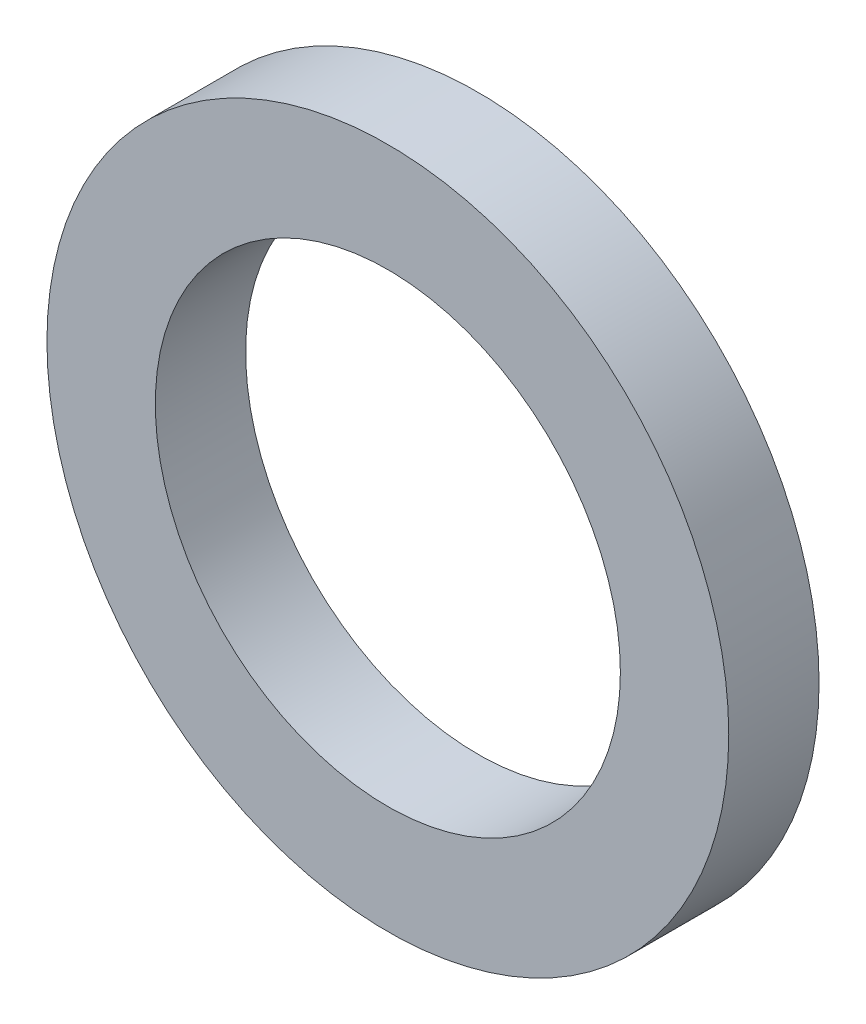
ISO-10303-21;
HEADER;
FILE_DESCRIPTION(('STEP AP214'),'2;1');
FILE_NAME('part.step','',(''),(''),'','','');
FILE_SCHEMA(('AUTOMOTIVE_DESIGN { 1 0 10303 214 1 1 1 1 }'));
ENDSEC;
DATA;
#1=APPLICATION_CONTEXT('core data for automotive mechanical design processes');
#2=APPLICATION_PROTOCOL_DEFINITION('international standard','automotive_design',2000,#1);
#3=PRODUCT_CONTEXT('',#1,'mechanical');
#4=PRODUCT('Part','Part','',(#3));
#5=PRODUCT_RELATED_PRODUCT_CATEGORY('part','',(#4));
#6=PRODUCT_DEFINITION_FORMATION('','',#4);
#7=PRODUCT_DEFINITION_CONTEXT('part definition',#1,'design');
#8=PRODUCT_DEFINITION('design','',#6,#7);
#9=PRODUCT_DEFINITION_SHAPE('','',#8);
#10=(LENGTH_UNIT() NAMED_UNIT(*) SI_UNIT(.MILLI.,.METRE.));
#11=(NAMED_UNIT(*) PLANE_ANGLE_UNIT() SI_UNIT($,.RADIAN.));
#12=(NAMED_UNIT(*) SI_UNIT($,.STERADIAN.) SOLID_ANGLE_UNIT());
#13=UNCERTAINTY_MEASURE_WITH_UNIT(LENGTH_MEASURE(1.E-05),#10,'distance_accuracy_value','');
#14=(GEOMETRIC_REPRESENTATION_CONTEXT(3) GLOBAL_UNCERTAINTY_ASSIGNED_CONTEXT((#13)) GLOBAL_UNIT_ASSIGNED_CONTEXT((#10,
#11,#12)) REPRESENTATION_CONTEXT('',''));
#15=CARTESIAN_POINT('',(0.,0.,0.));
#16=DIRECTION('',(0.,0.,1.));
#17=DIRECTION('',(1.,0.,0.));
#18=AXIS2_PLACEMENT_3D('',#15,#16,#17);
#19=CARTESIAN_POINT('',(0.,0.,1.));
#20=DIRECTION('',(0.,0.,1.));
#21=DIRECTION('',(1.,0.,0.));
#22=AXIS2_PLACEMENT_3D('',#19,#20,#21);
#23=PLANE('',#22);
#24=CARTESIAN_POINT('',(0.,0.,1.));
#25=DIRECTION('',(0.,0.,1.));
#26=DIRECTION('',(1.,0.,0.));
#27=AXIS2_PLACEMENT_3D('',#24,#25,#26);
#28=CIRCLE('',#27,3.775);
#29=CARTESIAN_POINT('',(3.775,0.,1.));
#30=VERTEX_POINT('',#29);
#31=EDGE_CURVE('E10',#30,#30,#28,.T.);
#32=ORIENTED_EDGE('',*,*,#31,.T.);
#33=EDGE_LOOP('',(#32));
#34=FACE_BOUND('',#33,.T.);
#35=CARTESIAN_POINT('',(0.,0.,1.));
#36=DIRECTION('',(0.,0.,1.));
#37=DIRECTION('',(1.,0.,0.));
#38=AXIS2_PLACEMENT_3D('',#35,#36,#37);
#39=CIRCLE('',#38,2.575);
#40=CARTESIAN_POINT('',(2.575,0.,1.));
#41=VERTEX_POINT('',#40);
#42=EDGE_CURVE('E54',#41,#41,#39,.T.);
#43=ORIENTED_EDGE('',*,*,#42,.F.);
#44=EDGE_LOOP('',(#43));
#45=FACE_BOUND('',#44,.T.);
#46=ADVANCED_FACE('F41',(#34,#45),#23,.T.);
#47=CARTESIAN_POINT('',(0.,0.,0.));
#48=DIRECTION('',(0.,0.,1.));
#49=DIRECTION('',(1.,0.,0.));
#50=AXIS2_PLACEMENT_3D('',#47,#48,#49);
#51=PLANE('',#50);
#52=CARTESIAN_POINT('',(0.,0.,0.));
#53=DIRECTION('',(0.,0.,1.));
#54=DIRECTION('',(1.,0.,0.));
#55=AXIS2_PLACEMENT_3D('',#52,#53,#54);
#56=CIRCLE('',#55,3.775);
#57=CARTESIAN_POINT('',(3.775,0.,0.));
#58=VERTEX_POINT('',#57);
#59=EDGE_CURVE('E45',#58,#58,#56,.T.);
#60=ORIENTED_EDGE('',*,*,#59,.F.);
#61=EDGE_LOOP('',(#60));
#62=FACE_BOUND('',#61,.T.);
#63=CARTESIAN_POINT('',(0.,0.,0.));
#64=DIRECTION('',(0.,0.,1.));
#65=DIRECTION('',(1.,0.,0.));
#66=AXIS2_PLACEMENT_3D('',#63,#64,#65);
#67=CIRCLE('',#66,2.575);
#68=CARTESIAN_POINT('',(2.575,0.,0.));
#69=VERTEX_POINT('',#68);
#70=EDGE_CURVE('E56',#69,#69,#67,.T.);
#71=ORIENTED_EDGE('',*,*,#70,.T.);
#72=EDGE_LOOP('',(#71));
#73=FACE_BOUND('',#72,.T.);
#74=ADVANCED_FACE('F68',(#62,#73),#51,.F.);
#75=CARTESIAN_POINT('',(0.,0.,1.));
#76=DIRECTION('',(0.,0.,-1.));
#77=DIRECTION('',(-1.,0.,0.));
#78=AXIS2_PLACEMENT_3D('',#75,#76,#77);
#79=CYLINDRICAL_SURFACE('',#78,3.775);
#80=ORIENTED_EDGE('',*,*,#31,.F.);
#81=EDGE_LOOP('',(#80));
#82=FACE_BOUND('',#81,.T.);
#83=ORIENTED_EDGE('',*,*,#59,.T.);
#84=EDGE_LOOP('',(#83));
#85=FACE_BOUND('',#84,.T.);
#86=ADVANCED_FACE('F43',(#82,#85),#79,.T.);
#87=CARTESIAN_POINT('',(0.,0.,1.));
#88=DIRECTION('',(0.,0.,-1.));
#89=DIRECTION('',(-1.,0.,0.));
#90=AXIS2_PLACEMENT_3D('',#87,#88,#89);
#91=CYLINDRICAL_SURFACE('',#90,2.575);
#92=ORIENTED_EDGE('',*,*,#42,.T.);
#93=EDGE_LOOP('',(#92));
#94=FACE_BOUND('',#93,.T.);
#95=ORIENTED_EDGE('',*,*,#70,.F.);
#96=EDGE_LOOP('',(#95));
#97=FACE_BOUND('',#96,.T.);
#98=ADVANCED_FACE('F64',(#94,#97),#91,.F.);
#99=CLOSED_SHELL('',(#46,#74,#86,#98));
#100=MANIFOLD_SOLID_BREP('B2',#99);
#101=ADVANCED_BREP_SHAPE_REPRESENTATION('',(#18,#100),#14);
#102=SHAPE_DEFINITION_REPRESENTATION(#9,#101);
ENDSEC;
END-ISO-10303-21;
